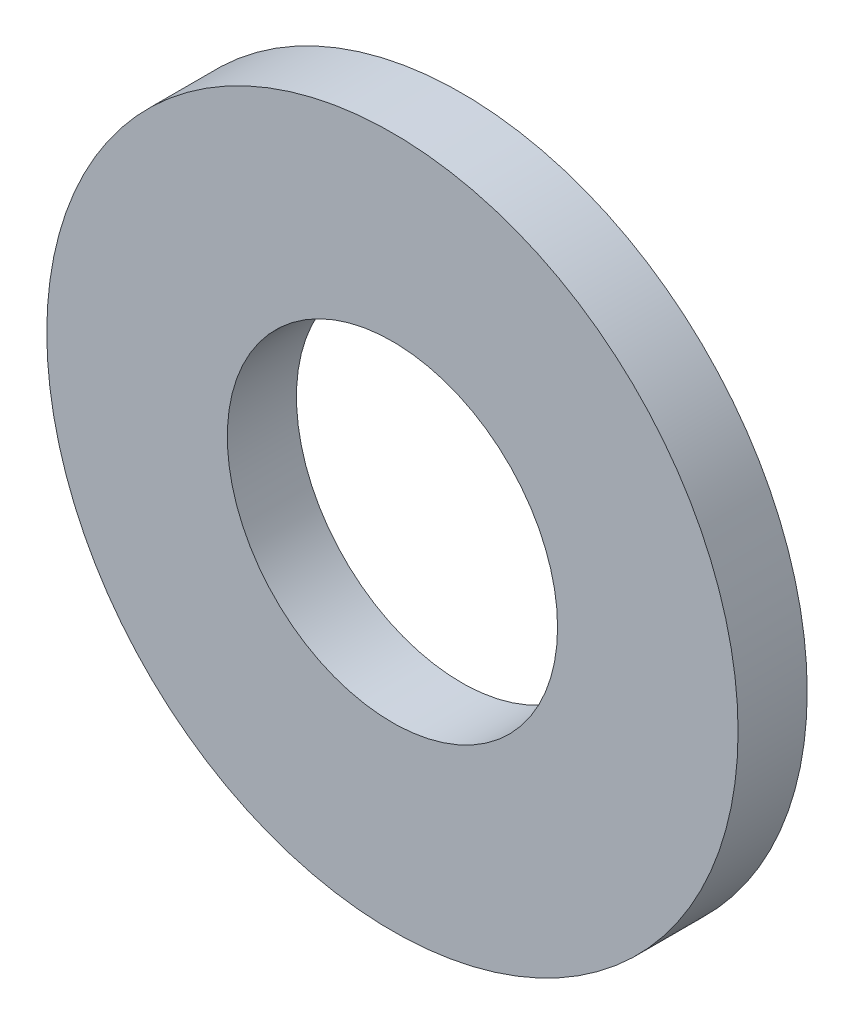
ISO-10303-21;
HEADER;
FILE_DESCRIPTION(('STEP AP214'),'2;1');
FILE_NAME('part.step','',(''),(''),'','','');
FILE_SCHEMA(('AUTOMOTIVE_DESIGN { 1 0 10303 214 1 1 1 1 }'));
ENDSEC;
DATA;
#1=APPLICATION_CONTEXT('core data for automotive mechanical design processes');
#2=APPLICATION_PROTOCOL_DEFINITION('international standard','automotive_design',2000,#1);
#3=PRODUCT_CONTEXT('',#1,'mechanical');
#4=PRODUCT('Part','Part','',(#3));
#5=PRODUCT_RELATED_PRODUCT_CATEGORY('part','',(#4));
#6=PRODUCT_DEFINITION_FORMATION('','',#4);
#7=PRODUCT_DEFINITION_CONTEXT('part definition',#1,'design');
#8=PRODUCT_DEFINITION('design','',#6,#7);
#9=PRODUCT_DEFINITION_SHAPE('','',#8);
#10=(LENGTH_UNIT() NAMED_UNIT(*) SI_UNIT(.MILLI.,.METRE.));
#11=(NAMED_UNIT(*) PLANE_ANGLE_UNIT() SI_UNIT($,.RADIAN.));
#12=(NAMED_UNIT(*) SI_UNIT($,.STERADIAN.) SOLID_ANGLE_UNIT());
#13=UNCERTAINTY_MEASURE_WITH_UNIT(LENGTH_MEASURE(1.E-05),#10,'distance_accuracy_value','');
#14=(GEOMETRIC_REPRESENTATION_CONTEXT(3) GLOBAL_UNCERTAINTY_ASSIGNED_CONTEXT((#13)) GLOBAL_UNIT_ASSIGNED_CONTEXT((#10,
#11,#12)) REPRESENTATION_CONTEXT('',''));
#15=CARTESIAN_POINT('',(0.,0.,0.));
#16=DIRECTION('',(0.,0.,1.));
#17=DIRECTION('',(1.,0.,0.));
#18=AXIS2_PLACEMENT_3D('',#15,#16,#17);
#19=CARTESIAN_POINT('',(0.,0.,0.9));
#20=DIRECTION('',(0.,0.,1.));
#21=DIRECTION('',(1.,0.,0.));
#22=AXIS2_PLACEMENT_3D('',#19,#20,#21);
#23=PLANE('',#22);
#24=CARTESIAN_POINT('',(0.,0.,0.9));
#25=DIRECTION('',(0.,0.,1.));
#26=DIRECTION('',(1.,0.,0.));
#27=AXIS2_PLACEMENT_3D('',#24,#25,#26);
#28=CIRCLE('',#27,4.5);
#29=CARTESIAN_POINT('',(4.5,0.,0.9));
#30=VERTEX_POINT('',#29);
#31=EDGE_CURVE('E10',#30,#30,#28,.T.);
#32=ORIENTED_EDGE('',*,*,#31,.T.);
#33=EDGE_LOOP('',(#32));
#34=FACE_BOUND('',#33,.T.);
#35=CARTESIAN_POINT('',(0.,0.,0.9));
#36=DIRECTION('',(0.,0.,1.));
#37=DIRECTION('',(1.,0.,0.));
#38=AXIS2_PLACEMENT_3D('',#35,#36,#37);
#39=CIRCLE('',#38,2.15);
#40=CARTESIAN_POINT('',(2.15,0.,0.9));
#41=VERTEX_POINT('',#40);
#42=EDGE_CURVE('E41',#41,#41,#39,.T.);
#43=ORIENTED_EDGE('',*,*,#42,.F.);
#44=EDGE_LOOP('',(#43));
#45=FACE_BOUND('',#44,.T.);
#46=ADVANCED_FACE('F30',(#34,#45),#23,.T.);
#47=CARTESIAN_POINT('',(0.,0.,0.));
#48=DIRECTION('',(0.,0.,1.));
#49=DIRECTION('',(1.,0.,0.));
#50=AXIS2_PLACEMENT_3D('',#47,#48,#49);
#51=PLANE('',#50);
#52=CARTESIAN_POINT('',(0.,0.,0.));
#53=DIRECTION('',(0.,0.,1.));
#54=DIRECTION('',(1.,0.,0.));
#55=AXIS2_PLACEMENT_3D('',#52,#53,#54);
#56=CIRCLE('',#55,4.5);
#57=CARTESIAN_POINT('',(4.5,0.,0.));
#58=VERTEX_POINT('',#57);
#59=EDGE_CURVE('E34',#58,#58,#56,.T.);
#60=ORIENTED_EDGE('',*,*,#59,.F.);
#61=EDGE_LOOP('',(#60));
#62=FACE_BOUND('',#61,.T.);
#63=CARTESIAN_POINT('',(0.,0.,0.));
#64=DIRECTION('',(0.,0.,1.));
#65=DIRECTION('',(1.,0.,0.));
#66=AXIS2_PLACEMENT_3D('',#63,#64,#65);
#67=CIRCLE('',#66,2.15);
#68=CARTESIAN_POINT('',(2.15,0.,0.));
#69=VERTEX_POINT('',#68);
#70=EDGE_CURVE('E43',#69,#69,#67,.T.);
#71=ORIENTED_EDGE('',*,*,#70,.T.);
#72=EDGE_LOOP('',(#71));
#73=FACE_BOUND('',#72,.T.);
#74=ADVANCED_FACE('F53',(#62,#73),#51,.F.);
#75=CARTESIAN_POINT('',(0.,0.,0.9));
#76=DIRECTION('',(0.,0.,-1.));
#77=DIRECTION('',(-1.,0.,0.));
#78=AXIS2_PLACEMENT_3D('',#75,#76,#77);
#79=CYLINDRICAL_SURFACE('',#78,4.5);
#80=ORIENTED_EDGE('',*,*,#31,.F.);
#81=EDGE_LOOP('',(#80));
#82=FACE_BOUND('',#81,.T.);
#83=ORIENTED_EDGE('',*,*,#59,.T.);
#84=EDGE_LOOP('',(#83));
#85=FACE_BOUND('',#84,.T.);
#86=ADVANCED_FACE('F32',(#82,#85),#79,.T.);
#87=CARTESIAN_POINT('',(0.,0.,0.9));
#88=DIRECTION('',(0.,0.,-1.));
#89=DIRECTION('',(-1.,0.,0.));
#90=AXIS2_PLACEMENT_3D('',#87,#88,#89);
#91=CYLINDRICAL_SURFACE('',#90,2.15);
#92=ORIENTED_EDGE('',*,*,#42,.T.);
#93=EDGE_LOOP('',(#92));
#94=FACE_BOUND('',#93,.T.);
#95=ORIENTED_EDGE('',*,*,#70,.F.);
#96=EDGE_LOOP('',(#95));
#97=FACE_BOUND('',#96,.T.);
#98=ADVANCED_FACE('F49',(#94,#97),#91,.F.);
#99=CLOSED_SHELL('',(#46,#74,#86,#98));
#100=MANIFOLD_SOLID_BREP('B2',#99);
#101=ADVANCED_BREP_SHAPE_REPRESENTATION('',(#18,#100),#14);
#102=SHAPE_DEFINITION_REPRESENTATION(#9,#101);
ENDSEC;
END-ISO-10303-21;
